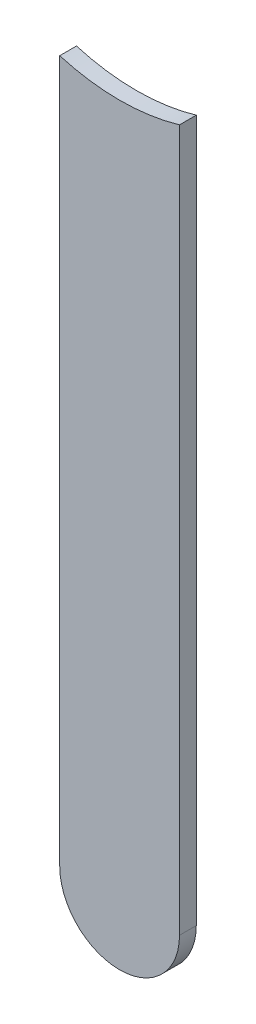
ISO-10303-21;
HEADER;
FILE_DESCRIPTION(('STEP AP214'),'2;1');
FILE_NAME('part.step','',(''),(''),'','','');
FILE_SCHEMA(('AUTOMOTIVE_DESIGN { 1 0 10303 214 1 1 1 1 }'));
ENDSEC;
DATA;
#1=APPLICATION_CONTEXT('core data for automotive mechanical design processes');
#2=APPLICATION_PROTOCOL_DEFINITION('international standard','automotive_design',2000,#1);
#3=PRODUCT_CONTEXT('',#1,'mechanical');
#4=PRODUCT('Part','Part','',(#3));
#5=PRODUCT_RELATED_PRODUCT_CATEGORY('part','',(#4));
#6=PRODUCT_DEFINITION_FORMATION('','',#4);
#7=PRODUCT_DEFINITION_CONTEXT('part definition',#1,'design');
#8=PRODUCT_DEFINITION('design','',#6,#7);
#9=PRODUCT_DEFINITION_SHAPE('','',#8);
#10=(LENGTH_UNIT() NAMED_UNIT(*) SI_UNIT(.MILLI.,.METRE.));
#11=(NAMED_UNIT(*) PLANE_ANGLE_UNIT() SI_UNIT($,.RADIAN.));
#12=(NAMED_UNIT(*) SI_UNIT($,.STERADIAN.) SOLID_ANGLE_UNIT());
#13=UNCERTAINTY_MEASURE_WITH_UNIT(LENGTH_MEASURE(1.E-05),#10,'distance_accuracy_value','');
#14=(GEOMETRIC_REPRESENTATION_CONTEXT(3) GLOBAL_UNCERTAINTY_ASSIGNED_CONTEXT((#13)) GLOBAL_UNIT_ASSIGNED_CONTEXT((#10,
#11,#12)) REPRESENTATION_CONTEXT('',''));
#15=CARTESIAN_POINT('',(0.,0.,0.));
#16=DIRECTION('',(0.,0.,1.));
#17=DIRECTION('',(1.,0.,0.));
#18=AXIS2_PLACEMENT_3D('',#15,#16,#17);
#19=CARTESIAN_POINT('',(86.5239824,85.66698386,0.));
#20=DIRECTION('',(-1.,0.,0.));
#21=DIRECTION('',(0.,1.,0.));
#22=AXIS2_PLACEMENT_3D('',#19,#20,#21);
#23=PLANE('',#22);
#24=DIRECTION('',(0.,1.,0.));
#25=VECTOR('',#24,1.);
#26=CARTESIAN_POINT('',(86.5239824,85.66698386,0.03556));
#27=LINE('',#26,#25);
#28=CARTESIAN_POINT('',(86.5239824,85.66698386,0.03556));
#29=VERTEX_POINT('',#28);
#30=CARTESIAN_POINT('',(86.5239824,87.1552662615206,0.03556));
#31=VERTEX_POINT('',#30);
#32=EDGE_CURVE('E11',#29,#31,#27,.T.);
#33=ORIENTED_EDGE('',*,*,#32,.F.);
#34=DIRECTION('',(0.,0.,1.));
#35=VECTOR('',#34,1.);
#36=CARTESIAN_POINT('',(86.5239824,85.66698386,0.));
#37=LINE('',#36,#35);
#38=CARTESIAN_POINT('',(86.5239824,85.66698386,0.));
#39=VERTEX_POINT('',#38);
#40=EDGE_CURVE('E24',#39,#29,#37,.T.);
#41=ORIENTED_EDGE('',*,*,#40,.F.);
#42=DIRECTION('',(0.,1.,0.));
#43=VECTOR('',#42,1.);
#44=CARTESIAN_POINT('',(86.5239824,85.66698386,0.));
#45=LINE('',#44,#43);
#46=CARTESIAN_POINT('',(86.5239824,87.1552662615206,0.));
#47=VERTEX_POINT('',#46);
#48=EDGE_CURVE('E75',#39,#47,#45,.T.);
#49=ORIENTED_EDGE('',*,*,#48,.T.);
#50=DIRECTION('',(0.,0.,1.));
#51=VECTOR('',#50,1.);
#52=CARTESIAN_POINT('',(86.5239824,87.1552662615206,0.));
#53=LINE('',#52,#51);
#54=EDGE_CURVE('E37',#47,#31,#53,.T.);
#55=ORIENTED_EDGE('',*,*,#54,.T.);
#56=EDGE_LOOP('',(#33,#41,#49,#55));
#57=FACE_BOUND('',#56,.T.);
#58=ADVANCED_FACE('F17',(#57),#23,.F.);
#59=CARTESIAN_POINT('',(86.3969824,87.5869724,0.));
#60=DIRECTION('',(0.,0.,-1.));
#61=DIRECTION('',(1.,0.,0.));
#62=AXIS2_PLACEMENT_3D('',#59,#60,#61);
#63=CYLINDRICAL_SURFACE('',#62,0.4499991);
#64=DIRECTION('',(0.,0.,1.));
#65=VECTOR('',#64,1.);
#66=CARTESIAN_POINT('',(86.2699824,87.1552662615206,0.));
#67=LINE('',#66,#65);
#68=CARTESIAN_POINT('',(86.2699824,87.1552662615206,0.));
#69=VERTEX_POINT('',#68);
#70=CARTESIAN_POINT('',(86.2699824,87.1552662615206,0.03556));
#71=VERTEX_POINT('',#70);
#72=EDGE_CURVE('E67',#69,#71,#67,.T.);
#73=ORIENTED_EDGE('',*,*,#72,.T.);
#74=CARTESIAN_POINT('',(86.3969824,87.5869724,0.03556));
#75=DIRECTION('',(0.,0.,1.));
#76=DIRECTION('',(1.,0.,0.));
#77=AXIS2_PLACEMENT_3D('',#74,#75,#76);
#78=CIRCLE('',#77,0.4499991);
#79=EDGE_CURVE('E82',#71,#31,#78,.T.);
#80=ORIENTED_EDGE('',*,*,#79,.T.);
#81=ORIENTED_EDGE('',*,*,#54,.F.);
#82=CARTESIAN_POINT('',(86.3969824,87.5869724,0.));
#83=DIRECTION('',(0.,0.,1.));
#84=DIRECTION('',(1.,0.,0.));
#85=AXIS2_PLACEMENT_3D('',#82,#83,#84);
#86=CIRCLE('',#85,0.4499991);
#87=EDGE_CURVE('E80',#69,#47,#86,.T.);
#88=ORIENTED_EDGE('',*,*,#87,.F.);
#89=EDGE_LOOP('',(#73,#80,#81,#88));
#90=FACE_BOUND('',#89,.T.);
#91=ADVANCED_FACE('F88',(#90),#63,.F.);
#92=CARTESIAN_POINT('',(86.2699824,87.1552662615206,0.));
#93=DIRECTION('',(1.,0.,0.));
#94=DIRECTION('',(0.,-1.,0.));
#95=AXIS2_PLACEMENT_3D('',#92,#93,#94);
#96=PLANE('',#95);
#97=DIRECTION('',(0.,-1.,0.));
#98=VECTOR('',#97,1.);
#99=CARTESIAN_POINT('',(86.2699824,87.5869724,0.03556));
#100=LINE('',#99,#98);
#101=CARTESIAN_POINT('',(86.2699824,85.66698386,0.03556));
#102=VERTEX_POINT('',#101);
#103=EDGE_CURVE('E71',#71,#102,#100,.T.);
#104=ORIENTED_EDGE('',*,*,#103,.F.);
#105=ORIENTED_EDGE('',*,*,#72,.F.);
#106=DIRECTION('',(0.,-1.,0.));
#107=VECTOR('',#106,1.);
#108=CARTESIAN_POINT('',(86.2699824,87.5869724,0.));
#109=LINE('',#108,#107);
#110=CARTESIAN_POINT('',(86.2699824,85.66698386,0.));
#111=VERTEX_POINT('',#110);
#112=EDGE_CURVE('E63',#69,#111,#109,.T.);
#113=ORIENTED_EDGE('',*,*,#112,.T.);
#114=DIRECTION('',(0.,0.,1.));
#115=VECTOR('',#114,1.);
#116=CARTESIAN_POINT('',(86.2699824,85.66698386,0.));
#117=LINE('',#116,#115);
#118=EDGE_CURVE('E53',#111,#102,#117,.T.);
#119=ORIENTED_EDGE('',*,*,#118,.T.);
#120=EDGE_LOOP('',(#104,#105,#113,#119));
#121=FACE_BOUND('',#120,.T.);
#122=ADVANCED_FACE('F66',(#121),#96,.F.);
#123=CARTESIAN_POINT('',(86.3969824,85.66698386,0.));
#124=DIRECTION('',(0.,0.,-1.));
#125=DIRECTION('',(-1.,-1.1189649382048E-13,0.));
#126=AXIS2_PLACEMENT_3D('',#123,#124,#125);
#127=CYLINDRICAL_SURFACE('',#126,0.127000000000005);
#128=CARTESIAN_POINT('',(86.3969824,85.66698386,0.03556));
#129=DIRECTION('',(0.,0.,1.));
#130=DIRECTION('',(-1.,-1.1189649382048E-13,0.));
#131=AXIS2_PLACEMENT_3D('',#128,#129,#130);
#132=CIRCLE('',#131,0.127000000000005);
#133=EDGE_CURVE('E59',#102,#29,#132,.T.);
#134=ORIENTED_EDGE('',*,*,#133,.F.);
#135=ORIENTED_EDGE('',*,*,#118,.F.);
#136=CARTESIAN_POINT('',(86.3969824,85.66698386,0.));
#137=DIRECTION('',(0.,0.,1.));
#138=DIRECTION('',(-1.,-1.1189649382048E-13,0.));
#139=AXIS2_PLACEMENT_3D('',#136,#137,#138);
#140=CIRCLE('',#139,0.127000000000005);
#141=EDGE_CURVE('E57',#111,#39,#140,.T.);
#142=ORIENTED_EDGE('',*,*,#141,.T.);
#143=ORIENTED_EDGE('',*,*,#40,.T.);
#144=EDGE_LOOP('',(#134,#135,#142,#143));
#145=FACE_BOUND('',#144,.T.);
#146=ADVANCED_FACE('F55',(#145),#127,.T.);
#147=CARTESIAN_POINT('',(86.5239824,85.66698386,0.));
#148=DIRECTION('',(0.,0.,-1.));
#149=DIRECTION('',(-1.,0.,0.));
#150=AXIS2_PLACEMENT_3D('',#147,#148,#149);
#151=PLANE('',#150);
#152=ORIENTED_EDGE('',*,*,#48,.F.);
#153=ORIENTED_EDGE('',*,*,#141,.F.);
#154=ORIENTED_EDGE('',*,*,#112,.F.);
#155=ORIENTED_EDGE('',*,*,#87,.T.);
#156=EDGE_LOOP('',(#152,#153,#154,#155));
#157=FACE_BOUND('',#156,.T.);
#158=ADVANCED_FACE('F74',(#157),#151,.T.);
#159=CARTESIAN_POINT('',(86.5239824,85.66698386,0.03556));
#160=DIRECTION('',(0.,0.,-1.));
#161=DIRECTION('',(-1.,0.,0.));
#162=AXIS2_PLACEMENT_3D('',#159,#160,#161);
#163=PLANE('',#162);
#164=ORIENTED_EDGE('',*,*,#133,.T.);
#165=ORIENTED_EDGE('',*,*,#32,.T.);
#166=ORIENTED_EDGE('',*,*,#79,.F.);
#167=ORIENTED_EDGE('',*,*,#103,.T.);
#168=EDGE_LOOP('',(#164,#165,#166,#167));
#169=FACE_BOUND('',#168,.T.);
#170=ADVANCED_FACE('F91',(#169),#163,.F.);
#171=CLOSED_SHELL('',(#58,#91,#122,#146,#158,#170));
#172=MANIFOLD_SOLID_BREP('B1',#171);
#173=ADVANCED_BREP_SHAPE_REPRESENTATION('',(#18,#172),#14);
#174=SHAPE_DEFINITION_REPRESENTATION(#9,#173);
ENDSEC;
END-ISO-10303-21;
